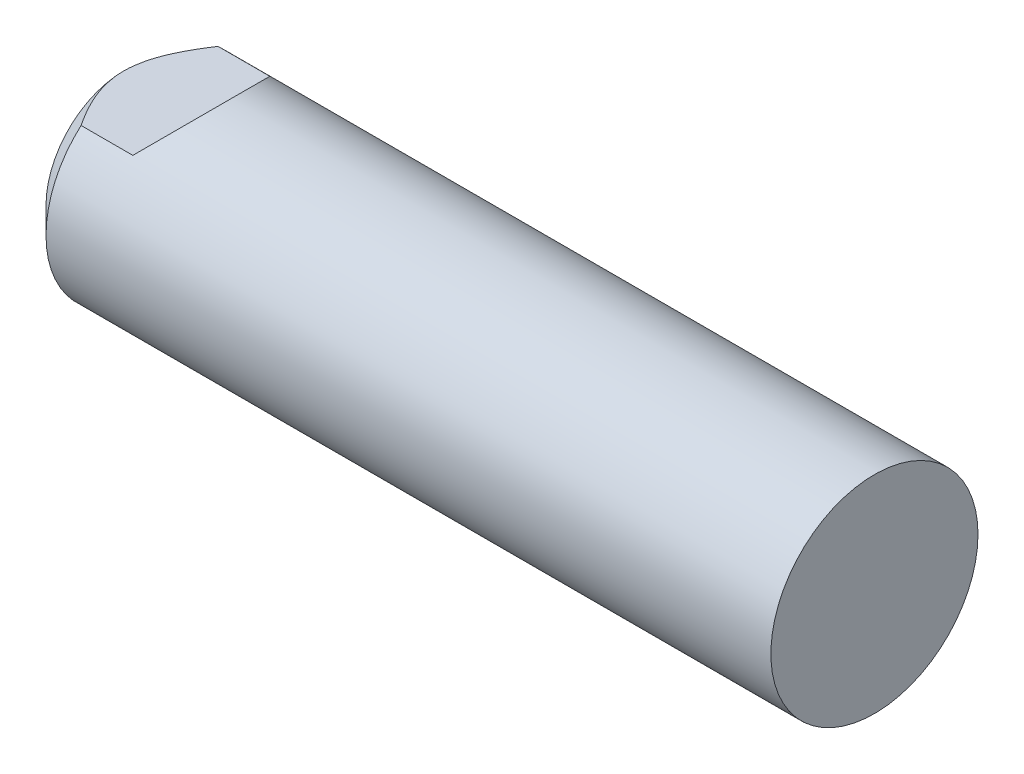
ISO-10303-21;
HEADER;
FILE_DESCRIPTION(('STEP AP214'),'2;1');
FILE_NAME('part.step','',(''),(''),'','','');
FILE_SCHEMA(('AUTOMOTIVE_DESIGN { 1 0 10303 214 1 1 1 1 }'));
ENDSEC;
DATA;
#1=APPLICATION_CONTEXT('core data for automotive mechanical design processes');
#2=APPLICATION_PROTOCOL_DEFINITION('international standard','automotive_design',2000,#1);
#3=PRODUCT_CONTEXT('',#1,'mechanical');
#4=PRODUCT('Part','Part','',(#3));
#5=PRODUCT_RELATED_PRODUCT_CATEGORY('part','',(#4));
#6=PRODUCT_DEFINITION_FORMATION('','',#4);
#7=PRODUCT_DEFINITION_CONTEXT('part definition',#1,'design');
#8=PRODUCT_DEFINITION('design','',#6,#7);
#9=PRODUCT_DEFINITION_SHAPE('','',#8);
#10=(LENGTH_UNIT() NAMED_UNIT(*) SI_UNIT(.MILLI.,.METRE.));
#11=(NAMED_UNIT(*) PLANE_ANGLE_UNIT() SI_UNIT($,.RADIAN.));
#12=(NAMED_UNIT(*) SI_UNIT($,.STERADIAN.) SOLID_ANGLE_UNIT());
#13=UNCERTAINTY_MEASURE_WITH_UNIT(LENGTH_MEASURE(1.E-05),#10,'distance_accuracy_value','');
#14=(GEOMETRIC_REPRESENTATION_CONTEXT(3) GLOBAL_UNCERTAINTY_ASSIGNED_CONTEXT((#13)) GLOBAL_UNIT_ASSIGNED_CONTEXT((#10,
#11,#12)) REPRESENTATION_CONTEXT('',''));
#15=CARTESIAN_POINT('',(0.,0.,0.));
#16=DIRECTION('',(0.,0.,1.));
#17=DIRECTION('',(1.,0.,0.));
#18=AXIS2_PLACEMENT_3D('',#15,#16,#17);
#19=CARTESIAN_POINT('',(4.49999999999995,0.,0.));
#20=DIRECTION('',(-1.,0.,0.));
#21=DIRECTION('',(0.,0.,1.));
#22=AXIS2_PLACEMENT_3D('',#19,#20,#21);
#23=CONICAL_SURFACE('',#22,1.621125,1.0471975511966);
#24=CARTESIAN_POINT('',(5.4359569551401,0.,1.11022302462516E-13));
#25=VERTEX_POINT('',#24);
#26=VERTEX_LOOP('',#25);
#27=FACE_BOUND('',#26,.T.);
#28=CARTESIAN_POINT('',(4.5,0.,0.));
#29=DIRECTION('',(-1.,0.,0.));
#30=DIRECTION('',(0.,0.,1.));
#31=AXIS2_PLACEMENT_3D('',#28,#29,#30);
#32=CIRCLE('',#31,1.621125);
#33=CARTESIAN_POINT('',(4.5,0.,1.621125));
#34=VERTEX_POINT('',#33);
#35=EDGE_CURVE('E73',#34,#34,#32,.T.);
#36=ORIENTED_EDGE('',*,*,#35,.T.);
#37=EDGE_LOOP('',(#36));
#38=FACE_BOUND('',#37,.T.);
#39=ADVANCED_FACE('F17',(#27,#38),#23,.F.);
#40=CARTESIAN_POINT('',(-6.5,0.,0.));
#41=DIRECTION('',(-1.,0.,0.));
#42=DIRECTION('',(0.,0.,1.));
#43=AXIS2_PLACEMENT_3D('',#40,#41,#42);
#44=CYLINDRICAL_SURFACE('',#43,1.621125);
#45=CARTESIAN_POINT('',(2.87887500002171,0.,0.));
#46=DIRECTION('',(-1.,0.,0.));
#47=DIRECTION('',(0.,0.,1.));
#48=AXIS2_PLACEMENT_3D('',#45,#46,#47);
#49=CIRCLE('',#48,1.62112500004241);
#50=CARTESIAN_POINT('',(2.87887500002171,0.,1.62112500004241));
#51=VERTEX_POINT('',#50);
#52=EDGE_CURVE('E75',#51,#51,#49,.T.);
#53=ORIENTED_EDGE('',*,*,#52,.T.);
#54=EDGE_LOOP('',(#53));
#55=FACE_BOUND('',#54,.T.);
#56=ORIENTED_EDGE('',*,*,#35,.F.);
#57=EDGE_LOOP('',(#56));
#58=FACE_BOUND('',#57,.T.);
#59=ADVANCED_FACE('F70',(#55,#58),#44,.F.);
#60=CARTESIAN_POINT('',(2.49999999999773,0.,0.));
#61=DIRECTION('',(-1.,0.,0.));
#62=DIRECTION('',(0.,0.,1.));
#63=AXIS2_PLACEMENT_3D('',#60,#61,#62);
#64=CONICAL_SURFACE('',#63,2.00000000006639,0.785398163472464);
#65=CARTESIAN_POINT('',(2.49999999999773,0.,0.));
#66=DIRECTION('',(-1.,0.,0.));
#67=DIRECTION('',(0.,0.,1.));
#68=AXIS2_PLACEMENT_3D('',#65,#66,#67);
#69=CIRCLE('',#68,2.00000000006639);
#70=CARTESIAN_POINT('',(2.49999999999773,0.,2.00000000006639));
#71=VERTEX_POINT('',#70);
#72=EDGE_CURVE('E20',#71,#71,#69,.F.);
#73=ORIENTED_EDGE('',*,*,#72,.F.);
#74=EDGE_LOOP('',(#73));
#75=FACE_BOUND('',#74,.T.);
#76=ORIENTED_EDGE('',*,*,#52,.F.);
#77=EDGE_LOOP('',(#76));
#78=FACE_BOUND('',#77,.T.);
#79=ADVANCED_FACE('F181',(#75,#78),#64,.F.);
#80=CARTESIAN_POINT('',(2.5,2.,0.));
#81=DIRECTION('',(1.,0.,0.));
#82=DIRECTION('',(0.,0.,-1.));
#83=AXIS2_PLACEMENT_3D('',#80,#81,#82);
#84=PLANE('',#83);
#85=ORIENTED_EDGE('',*,*,#72,.T.);
#86=EDGE_LOOP('',(#85));
#87=FACE_BOUND('',#86,.T.);
#88=CARTESIAN_POINT('',(2.5,0.,0.));
#89=DIRECTION('',(-1.,0.,0.));
#90=DIRECTION('',(0.,0.,1.));
#91=AXIS2_PLACEMENT_3D('',#88,#89,#90);
#92=CIRCLE('',#91,1.621125);
#93=CARTESIAN_POINT('',(2.5,0.,1.621125));
#94=VERTEX_POINT('',#93);
#95=EDGE_CURVE('E169',#94,#94,#92,.T.);
#96=ORIENTED_EDGE('',*,*,#95,.T.);
#97=EDGE_LOOP('',(#96));
#98=FACE_BOUND('',#97,.T.);
#99=ADVANCED_FACE('F179',(#87,#98),#84,.T.);
#100=CARTESIAN_POINT('',(-6.5,0.,0.));
#101=DIRECTION('',(-1.,0.,0.));
#102=DIRECTION('',(0.,0.,1.));
#103=AXIS2_PLACEMENT_3D('',#100,#101,#102);
#104=CYLINDRICAL_SURFACE('',#103,1.621125);
#105=CARTESIAN_POINT('',(-5.12112500001649,0.,0.));
#106=DIRECTION('',(-1.,0.,0.));
#107=DIRECTION('',(0.,0.,1.));
#108=AXIS2_PLACEMENT_3D('',#105,#106,#107);
#109=CIRCLE('',#108,1.62112500004241);
#110=CARTESIAN_POINT('',(-5.12112500001649,0.,1.62112500004241));
#111=VERTEX_POINT('',#110);
#112=EDGE_CURVE('E166',#111,#111,#109,.T.);
#113=ORIENTED_EDGE('',*,*,#112,.T.);
#114=EDGE_LOOP('',(#113));
#115=FACE_BOUND('',#114,.T.);
#116=ORIENTED_EDGE('',*,*,#95,.F.);
#117=EDGE_LOOP('',(#116));
#118=FACE_BOUND('',#117,.T.);
#119=ADVANCED_FACE('F275',(#115,#118),#104,.F.);
#120=CARTESIAN_POINT('',(-5.49999999992679,0.,0.));
#121=DIRECTION('',(-1.,0.,0.));
#122=DIRECTION('',(0.,0.,1.));
#123=AXIS2_PLACEMENT_3D('',#120,#121,#122);
#124=CONICAL_SURFACE('',#123,1.99999999995271,0.785398163397448);
#125=CARTESIAN_POINT('',(-5.49999999998363,0.,0.));
#126=DIRECTION('',(-1.,0.,0.));
#127=DIRECTION('',(0.,0.,1.));
#128=AXIS2_PLACEMENT_3D('',#125,#126,#127);
#129=CIRCLE('',#128,2.00000000000955);
#130=CARTESIAN_POINT('',(-5.49999999998363,0.,2.00000000000955));
#131=VERTEX_POINT('',#130);
#132=EDGE_CURVE('E168',#131,#131,#129,.F.);
#133=ORIENTED_EDGE('',*,*,#132,.F.);
#134=EDGE_LOOP('',(#133));
#135=FACE_BOUND('',#134,.T.);
#136=ORIENTED_EDGE('',*,*,#112,.F.);
#137=EDGE_LOOP('',(#136));
#138=FACE_BOUND('',#137,.T.);
#139=ADVANCED_FACE('F267',(#135,#138),#124,.F.);
#140=CARTESIAN_POINT('',(-5.5,0.,0.));
#141=DIRECTION('',(-1.,0.,0.));
#142=DIRECTION('',(0.,0.,1.));
#143=AXIS2_PLACEMENT_3D('',#140,#141,#142);
#144=PLANE('',#143);
#145=ORIENTED_EDGE('',*,*,#132,.T.);
#146=EDGE_LOOP('',(#145));
#147=FACE_BOUND('',#146,.T.);
#148=CARTESIAN_POINT('',(-5.49999999998363,0.,0.));
#149=DIRECTION('',(1.,0.,0.));
#150=DIRECTION('',(0.,0.,-1.));
#151=AXIS2_PLACEMENT_3D('',#148,#149,#150);
#152=CIRCLE('',#151,2.9999999999859);
#153=CARTESIAN_POINT('',(-5.49999999997658,-2.99999999999295,0.));
#154=VERTEX_POINT('',#153);
#155=CARTESIAN_POINT('',(-5.49999999997658,2.99999999999295,0.));
#156=VERTEX_POINT('',#155);
#157=EDGE_CURVE('E64',#154,#156,#152,.T.);
#158=ORIENTED_EDGE('',*,*,#157,.F.);
#159=CARTESIAN_POINT('',(-5.49999999998363,0.,0.));
#160=DIRECTION('',(1.,0.,0.));
#161=DIRECTION('',(0.,0.,-1.));
#162=AXIS2_PLACEMENT_3D('',#159,#160,#161);
#163=CIRCLE('',#162,2.9999999999859);
#164=EDGE_CURVE('E123',#156,#154,#163,.T.);
#165=ORIENTED_EDGE('',*,*,#164,.F.);
#166=EDGE_LOOP('',(#158,#165));
#167=FACE_BOUND('',#166,.T.);
#168=ADVANCED_FACE('F111',(#147,#167),#144,.T.);
#169=CARTESIAN_POINT('',(-4.50000000000728,0.,0.));
#170=DIRECTION('',(1.,0.,0.));
#171=DIRECTION('',(0.,0.,-1.));
#172=AXIS2_PLACEMENT_3D('',#169,#170,#171);
#173=CONICAL_SURFACE('',#172,4.0000000000191,0.78539816342587);
#174=CARTESIAN_POINT('',(-4.50000000001569,2.99999999999424,-2.64575131107497));
#175=CARTESIAN_POINT('',(-4.5437667715263,2.99999999999788,-2.57957305225181));
#176=CARTESIAN_POINT('',(-4.58689929972828,2.99999999999942,-2.51297659820835));
#177=CARTESIAN_POINT('',(-4.67167711883806,3.00000000000058,-2.37881643452654));
#178=CARTESIAN_POINT('',(-4.7133219529824,3.0000000000002,-2.31125243659465));
#179=CARTESIAN_POINT('',(-4.8360815240135,2.99999999999959,-2.10626474709709));
#180=CARTESIAN_POINT('',(-4.91456071476483,2.99999999999989,-1.96723203213452));
#181=CARTESIAN_POINT('',(-5.05937750553316,3.0000000000001,-1.68866176513114));
#182=CARTESIAN_POINT('',(-5.12602744978497,3.00000000000003,-1.54928833782922));
#183=CARTESIAN_POINT('',(-5.24660228945435,2.99999999999997,-1.26532297430557));
#184=CARTESIAN_POINT('',(-5.30055451712987,2.99999999999999,-1.12074303388091));
#185=CARTESIAN_POINT('',(-5.37010131824994,3.,-0.895422710444213));
#186=CARTESIAN_POINT('',(-5.39181483049578,3.,-0.816563520725403));
#187=CARTESIAN_POINT('',(-5.42975833931034,3.,-0.657532168085849));
#188=CARTESIAN_POINT('',(-5.44598924429282,3.,-0.577360224985659));
#189=CARTESIAN_POINT('',(-5.47255276790591,3.,-0.414674081445588));
#190=CARTESIAN_POINT('',(-5.48278379506886,3.,-0.332143053581368));
#191=CARTESIAN_POINT('',(-5.49653824467008,3.,-0.166418216043385));
#192=CARTESIAN_POINT('',(-5.50005272978429,3.,-0.0832236709832054));
#193=CARTESIAN_POINT('',(-5.49999999996953,3.,2.28829592084202E-13));
#194=B_SPLINE_CURVE_WITH_KNOTS('',3,(#174,#175,#176,#177,#178,#179,#180,#181,#182,#183,#184,
#185,#186,#187,#188,#189,#190,#191,#192,#193),.UNSPECIFIED.,.F.,.F.,(4,2,2,2,2,2,2,2,2,4),(0.,
0.238016031598389,0.476104523421487,0.954759677948819,1.41781524456464,1.87986476111801,
2.1250843961537,2.37026338077123,2.61948213569905,2.86903228171086),.UNSPECIFIED.);
#195=CARTESIAN_POINT('',(-4.50000000000917,3.,-2.64575131107066));
#196=VERTEX_POINT('',#195);
#197=EDGE_CURVE('E116',#196,#156,#194,.T.);
#198=ORIENTED_EDGE('',*,*,#197,.F.);
#199=CARTESIAN_POINT('',(-4.5,0.,0.));
#200=DIRECTION('',(1.,0.,0.));
#201=DIRECTION('',(0.,0.,-1.));
#202=AXIS2_PLACEMENT_3D('',#199,#200,#201);
#203=CIRCLE('',#202,4.);
#204=CARTESIAN_POINT('',(-4.50000000000917,-3.,-2.64575131107066));
#205=VERTEX_POINT('',#204);
#206=EDGE_CURVE('E144',#205,#196,#203,.T.);
#207=ORIENTED_EDGE('',*,*,#206,.F.);
#208=CARTESIAN_POINT('',(-5.49999999997025,-3.00000000000172,0.));
#209=CARTESIAN_POINT('',(-5.50000372117897,-3.00000000000063,-0.046131691551775));
#210=CARTESIAN_POINT('',(-5.4989354024498,-3.00000000000017,-0.0922565617470997));
#211=CARTESIAN_POINT('',(-5.49468966303293,-2.99999999999983,-0.184401809990065));
#212=CARTESIAN_POINT('',(-5.49151258706288,-2.99999999999994,-0.23042220388283));
#213=CARTESIAN_POINT('',(-5.47888814511782,-3.00000000000012,-0.368016843255623));
#214=CARTESIAN_POINT('',(-5.46634726481252,-3.00000000000003,-0.45932231403875));
#215=CARTESIAN_POINT('',(-5.43396065682086,-2.99999999999997,-0.638969685759325));
#216=CARTESIAN_POINT('',(-5.4142444975668,-2.99999999999999,-0.727335543289764));
#217=CARTESIAN_POINT('',(-5.36836032776412,-3.00000000000001,-0.902389209018686));
#218=CARTESIAN_POINT('',(-5.34218991802978,-3.,-0.989076380259884));
#219=CARTESIAN_POINT('',(-5.26673864620213,-3.,-1.21279133796776));
#220=CARTESIAN_POINT('',(-5.21308700663016,-3.,-1.34834245284789));
#221=CARTESIAN_POINT('',(-5.09509922819485,-3.,-1.61482672286751));
#222=CARTESIAN_POINT('',(-5.03074718960358,-3.,-1.74575264908766));
#223=CARTESIAN_POINT('',(-4.89212992621364,-3.,-2.00733665808053));
#224=CARTESIAN_POINT('',(-4.81762251163764,-3.,-2.13786518931024));
#225=CARTESIAN_POINT('',(-4.7014336951254,-3.,-2.330602245504));
#226=CARTESIAN_POINT('',(-4.66204708986501,-3.,-2.39421775336658));
#227=CARTESIAN_POINT('',(-4.58196164613293,-3.,-2.52059663706342));
#228=CARTESIAN_POINT('',(-4.54126312775921,-3.,-2.5833602155305));
#229=CARTESIAN_POINT('',(-4.50000000001881,-3.,-2.64575131107602));
#230=B_SPLINE_CURVE_WITH_KNOTS('',3,(#208,#209,#210,#211,#212,#213,#214,#215,#216,#217,#218,
#219,#220,#221,#222,#223,#224,#225,#226,#227,#228,#229),.UNSPECIFIED.,.F.,.F.,(4,2,2,2,2,2,2,2,
2,2,4),(0.,0.138369672911176,0.276716732160864,0.552819786135426,0.82416619599298,
1.09561362366332,1.53229133174999,1.96962379477843,2.42027307715156,2.64472553087359,
2.86912362817228),.UNSPECIFIED.);
#231=EDGE_CURVE('E88',#154,#205,#230,.T.);
#232=ORIENTED_EDGE('',*,*,#231,.F.);
#233=ORIENTED_EDGE('',*,*,#157,.T.);
#234=EDGE_LOOP('',(#198,#207,#232,#233));
#235=FACE_BOUND('',#234,.T.);
#236=ADVANCED_FACE('F105',(#235),#173,.T.);
#237=CARTESIAN_POINT('',(-2.5,3.,4.));
#238=DIRECTION('',(-0.707106781186548,0.707106781186548,0.));
#239=DIRECTION('',(-0.707106781186548,-0.707106781186548,0.));
#240=AXIS2_PLACEMENT_3D('',#237,#238,#239);
#241=PLANE('',#240);
#242=CARTESIAN_POINT('',(-5.5,0.,0.));
#243=DIRECTION('',(-0.707106781186548,0.707106781186548,0.));
#244=DIRECTION('',(0.707106781186548,0.707106781186548,0.));
#245=AXIS2_PLACEMENT_3D('',#242,#243,#244);
#246=ELLIPSE('',#245,5.65685424949238,4.);
#247=CARTESIAN_POINT('',(-2.5,3.,-2.64575131106459));
#248=VERTEX_POINT('',#247);
#249=CARTESIAN_POINT('',(-2.5,3.,2.64575131106459));
#250=VERTEX_POINT('',#249);
#251=EDGE_CURVE('E83',#248,#250,#246,.F.);
#252=ORIENTED_EDGE('',*,*,#251,.F.);
#253=DIRECTION('',(0.,0.,1.));
#254=VECTOR('',#253,1.);
#255=CARTESIAN_POINT('',(-2.5,3.,4.));
#256=LINE('',#255,#254);
#257=EDGE_CURVE('E124',#250,#248,#256,.F.);
#258=ORIENTED_EDGE('',*,*,#257,.F.);
#259=EDGE_LOOP('',(#252,#258));
#260=FACE_BOUND('',#259,.T.);
#261=ADVANCED_FACE('F110',(#260),#241,.T.);
#262=CARTESIAN_POINT('',(-6.5,3.,4.));
#263=DIRECTION('',(0.,1.,0.));
#264=DIRECTION('',(0.,0.,1.));
#265=AXIS2_PLACEMENT_3D('',#262,#263,#264);
#266=PLANE('',#265);
#267=CARTESIAN_POINT('',(-4.50000000001745,3.,2.64575131107809));
#268=CARTESIAN_POINT('',(-4.54376677152646,3.,2.57957305225373));
#269=CARTESIAN_POINT('',(-4.5868992997278,3.,2.5129765982097));
#270=CARTESIAN_POINT('',(-4.6716771188372,3.,2.3788164345273));
#271=CARTESIAN_POINT('',(-4.71332195298181,3.,2.31125243659542));
#272=CARTESIAN_POINT('',(-4.83608152401345,3.,2.10626474709764));
#273=CARTESIAN_POINT('',(-4.91456071476481,3.,1.9672320321347));
#274=CARTESIAN_POINT('',(-5.05937750553334,3.,1.68866176513066));
#275=CARTESIAN_POINT('',(-5.12602744978532,3.,1.54928833782845));
#276=CARTESIAN_POINT('',(-5.24660228945493,3.,1.26532297430417));
#277=CARTESIAN_POINT('',(-5.30055451713049,3.,1.12074303387918));
#278=CARTESIAN_POINT('',(-5.37010131825048,3.,0.895422710442314));
#279=CARTESIAN_POINT('',(-5.39181483049622,3.,0.816563520723678));
#280=CARTESIAN_POINT('',(-5.42975833931064,3.,0.657532168084474));
#281=CARTESIAN_POINT('',(-5.44598924429304,3.,0.577360224984462));
#282=CARTESIAN_POINT('',(-5.47255276790602,3.,0.414674081444771));
#283=CARTESIAN_POINT('',(-5.48278379506892,3.,0.332143053580754));
#284=CARTESIAN_POINT('',(-5.49653824467009,3.,0.166418216043187));
#285=CARTESIAN_POINT('',(-5.50005272978428,3.,0.0832236709832204));
#286=CARTESIAN_POINT('',(-5.49999999996953,3.,0.));
#287=B_SPLINE_CURVE_WITH_KNOTS('',3,(#267,#268,#269,#270,#271,#272,#273,#274,#275,#276,#277,
#278,#279,#280,#281,#282,#283,#284,#285,#286),.UNSPECIFIED.,.F.,.F.,(4,2,2,2,2,2,2,2,2,4),(0.,
0.238016031598794,0.476104523422332,0.954759677950648,1.41781524456749,1.87986476112184,
2.12508439615696,2.37026338077392,2.61948213570112,2.8690322817123),.UNSPECIFIED.);
#288=CARTESIAN_POINT('',(-4.50000000000872,3.,2.64575131107134));
#289=VERTEX_POINT('',#288);
#290=EDGE_CURVE('E133',#289,#156,#287,.T.);
#291=ORIENTED_EDGE('',*,*,#290,.F.);
#292=DIRECTION('',(1.,0.,0.));
#293=VECTOR('',#292,1.);
#294=CARTESIAN_POINT('',(-5.5,3.,2.64575131106459));
#295=LINE('',#294,#293);
#296=EDGE_CURVE('E86',#250,#289,#295,.F.);
#297=ORIENTED_EDGE('',*,*,#296,.F.);
#298=ORIENTED_EDGE('',*,*,#257,.T.);
#299=DIRECTION('',(1.,0.,0.));
#300=VECTOR('',#299,1.);
#301=CARTESIAN_POINT('',(-5.5,3.,-2.64575131106459));
#302=LINE('',#301,#300);
#303=EDGE_CURVE('E87',#196,#248,#302,.T.);
#304=ORIENTED_EDGE('',*,*,#303,.F.);
#305=ORIENTED_EDGE('',*,*,#197,.T.);
#306=EDGE_LOOP('',(#291,#297,#298,#304,#305));
#307=FACE_BOUND('',#306,.T.);
#308=ADVANCED_FACE('F126',(#307),#266,.T.);
#309=CARTESIAN_POINT('',(-4.50000000000728,0.,0.));
#310=DIRECTION('',(1.,0.,0.));
#311=DIRECTION('',(0.,0.,-1.));
#312=AXIS2_PLACEMENT_3D('',#309,#310,#311);
#313=CONICAL_SURFACE('',#312,4.0000000000191,0.78539816342587);
#314=CARTESIAN_POINT('',(-4.5,0.,0.));
#315=DIRECTION('',(1.,0.,0.));
#316=DIRECTION('',(0.,0.,-1.));
#317=AXIS2_PLACEMENT_3D('',#314,#315,#316);
#318=CIRCLE('',#317,4.);
#319=CARTESIAN_POINT('',(-4.50000000000917,-3.,2.64575131107066));
#320=VERTEX_POINT('',#319);
#321=EDGE_CURVE('E149',#289,#320,#318,.T.);
#322=ORIENTED_EDGE('',*,*,#321,.F.);
#323=ORIENTED_EDGE('',*,*,#290,.T.);
#324=ORIENTED_EDGE('',*,*,#164,.T.);
#325=CARTESIAN_POINT('',(-4.50000000001569,-2.99999999999424,2.64575131107497));
#326=CARTESIAN_POINT('',(-4.5437667715263,-2.99999999999788,2.57957305225182));
#327=CARTESIAN_POINT('',(-4.58689929972828,-2.99999999999942,2.51297659820835));
#328=CARTESIAN_POINT('',(-4.67167711883806,-3.00000000000058,2.37881643452654));
#329=CARTESIAN_POINT('',(-4.7133219529824,-3.0000000000002,2.31125243659465));
#330=CARTESIAN_POINT('',(-4.8360815240135,-2.99999999999959,2.10626474709709));
#331=CARTESIAN_POINT('',(-4.91456071476483,-2.99999999999989,1.96723203213452));
#332=CARTESIAN_POINT('',(-5.05937750553316,-3.0000000000001,1.68866176513114));
#333=CARTESIAN_POINT('',(-5.12602744978497,-3.00000000000003,1.54928833782922));
#334=CARTESIAN_POINT('',(-5.24660228945436,-2.99999999999997,1.26532297430557));
#335=CARTESIAN_POINT('',(-5.30055451712987,-2.99999999999999,1.12074303388091));
#336=CARTESIAN_POINT('',(-5.37010131824994,-3.,0.895422710444214));
#337=CARTESIAN_POINT('',(-5.39181483049578,-3.,0.816563520725405));
#338=CARTESIAN_POINT('',(-5.42975833931034,-3.,0.657532168085851));
#339=CARTESIAN_POINT('',(-5.44598924429282,-3.,0.577360224985663));
#340=CARTESIAN_POINT('',(-5.47255276790591,-3.,0.414674081445593));
#341=CARTESIAN_POINT('',(-5.48278379506886,-3.,0.332143053581375));
#342=CARTESIAN_POINT('',(-5.49653824467008,-3.,0.166418216043393));
#343=CARTESIAN_POINT('',(-5.50005272978429,-3.,0.0832236709832141));
#344=CARTESIAN_POINT('',(-5.49999999996953,-3.,-2.1946413647967E-13));
#345=B_SPLINE_CURVE_WITH_KNOTS('',3,(#325,#326,#327,#328,#329,#330,#331,#332,#333,#334,#335,
#336,#337,#338,#339,#340,#341,#342,#343,#344),.UNSPECIFIED.,.F.,.F.,(4,2,2,2,2,2,2,2,2,4),(0.,
0.238016031598389,0.476104523421487,0.954759677948819,1.41781524456464,1.87986476111801,
2.1250843961537,2.37026338077123,2.61948213569904,2.86903228171085),.UNSPECIFIED.);
#346=EDGE_CURVE('E96',#320,#154,#345,.T.);
#347=ORIENTED_EDGE('',*,*,#346,.F.);
#348=EDGE_LOOP('',(#322,#323,#324,#347));
#349=FACE_BOUND('',#348,.T.);
#350=ADVANCED_FACE('F129',(#349),#313,.T.);
#351=CARTESIAN_POINT('',(-6.5,-3.,-4.));
#352=DIRECTION('',(0.,-1.,0.));
#353=DIRECTION('',(0.,0.,-1.));
#354=AXIS2_PLACEMENT_3D('',#351,#352,#353);
#355=PLANE('',#354);
#356=ORIENTED_EDGE('',*,*,#231,.T.);
#357=DIRECTION('',(1.,0.,0.));
#358=VECTOR('',#357,1.);
#359=CARTESIAN_POINT('',(-5.5,-3.,-2.64575131106459));
#360=LINE('',#359,#358);
#361=CARTESIAN_POINT('',(-2.5,-3.,-2.64575131106459));
#362=VERTEX_POINT('',#361);
#363=EDGE_CURVE('E164',#362,#205,#360,.F.);
#364=ORIENTED_EDGE('',*,*,#363,.F.);
#365=DIRECTION('',(0.,0.,1.));
#366=VECTOR('',#365,1.);
#367=CARTESIAN_POINT('',(-2.5,-3.,-4.));
#368=LINE('',#367,#366);
#369=CARTESIAN_POINT('',(-2.5,-3.,2.64575131106459));
#370=VERTEX_POINT('',#369);
#371=EDGE_CURVE('E35',#370,#362,#368,.F.);
#372=ORIENTED_EDGE('',*,*,#371,.F.);
#373=DIRECTION('',(1.,0.,0.));
#374=VECTOR('',#373,1.);
#375=CARTESIAN_POINT('',(-5.5,-3.,2.64575131106459));
#376=LINE('',#375,#374);
#377=EDGE_CURVE('E82',#320,#370,#376,.T.);
#378=ORIENTED_EDGE('',*,*,#377,.F.);
#379=ORIENTED_EDGE('',*,*,#346,.T.);
#380=EDGE_LOOP('',(#356,#364,#372,#378,#379));
#381=FACE_BOUND('',#380,.T.);
#382=ADVANCED_FACE('F102',(#381),#355,.T.);
#383=CARTESIAN_POINT('',(-2.5,-3.,-4.));
#384=DIRECTION('',(-0.707106781186548,-0.707106781186548,0.));
#385=DIRECTION('',(0.707106781186548,-0.707106781186548,0.));
#386=AXIS2_PLACEMENT_3D('',#383,#384,#385);
#387=PLANE('',#386);
#388=ORIENTED_EDGE('',*,*,#371,.T.);
#389=CARTESIAN_POINT('',(-5.5,0.,0.));
#390=DIRECTION('',(-0.707106781186548,-0.707106781186548,0.));
#391=DIRECTION('',(0.707106781186548,-0.707106781186548,0.));
#392=AXIS2_PLACEMENT_3D('',#389,#390,#391);
#393=ELLIPSE('',#392,5.65685424949238,4.);
#394=EDGE_CURVE('E26',#370,#362,#393,.F.);
#395=ORIENTED_EDGE('',*,*,#394,.F.);
#396=EDGE_LOOP('',(#388,#395));
#397=FACE_BOUND('',#396,.T.);
#398=ADVANCED_FACE('F197',(#397),#387,.T.);
#399=CARTESIAN_POINT('',(23.5,0.,0.));
#400=DIRECTION('',(1.,0.,0.));
#401=DIRECTION('',(0.,0.,-1.));
#402=AXIS2_PLACEMENT_3D('',#399,#400,#401);
#403=PLANE('',#402);
#404=CARTESIAN_POINT('',(23.5,0.,0.));
#405=DIRECTION('',(1.,0.,0.));
#406=DIRECTION('',(0.,0.,-1.));
#407=AXIS2_PLACEMENT_3D('',#404,#405,#406);
#408=CIRCLE('',#407,4.);
#409=CARTESIAN_POINT('',(23.5,0.,-4.));
#410=VERTEX_POINT('',#409);
#411=EDGE_CURVE('E11',#410,#410,#408,.F.);
#412=ORIENTED_EDGE('',*,*,#411,.F.);
#413=EDGE_LOOP('',(#412));
#414=FACE_BOUND('',#413,.T.);
#415=ADVANCED_FACE('F192',(#414),#403,.T.);
#416=CARTESIAN_POINT('',(-5.5,0.,0.));
#417=DIRECTION('',(1.,0.,0.));
#418=DIRECTION('',(0.,0.,-1.));
#419=AXIS2_PLACEMENT_3D('',#416,#417,#418);
#420=CYLINDRICAL_SURFACE('',#419,4.);
#421=ORIENTED_EDGE('',*,*,#303,.T.);
#422=ORIENTED_EDGE('',*,*,#251,.T.);
#423=ORIENTED_EDGE('',*,*,#296,.T.);
#424=ORIENTED_EDGE('',*,*,#321,.T.);
#425=ORIENTED_EDGE('',*,*,#377,.T.);
#426=ORIENTED_EDGE('',*,*,#394,.T.);
#427=ORIENTED_EDGE('',*,*,#363,.T.);
#428=ORIENTED_EDGE('',*,*,#206,.T.);
#429=EDGE_LOOP('',(#421,#422,#423,#424,#425,#426,#427,#428));
#430=FACE_BOUND('',#429,.T.);
#431=ORIENTED_EDGE('',*,*,#411,.T.);
#432=EDGE_LOOP('',(#431));
#433=FACE_BOUND('',#432,.T.);
#434=ADVANCED_FACE('F153',(#430,#433),#420,.T.);
#435=CLOSED_SHELL('',(#39,#59,#79,#99,#119,#139,#168,#236,#261,#308,#350,#382,#398,#415,#434));
#436=MANIFOLD_SOLID_BREP('B1',#435);
#437=ADVANCED_BREP_SHAPE_REPRESENTATION('',(#18,#436),#14);
#438=SHAPE_DEFINITION_REPRESENTATION(#9,#437);
ENDSEC;
END-ISO-10303-21;
